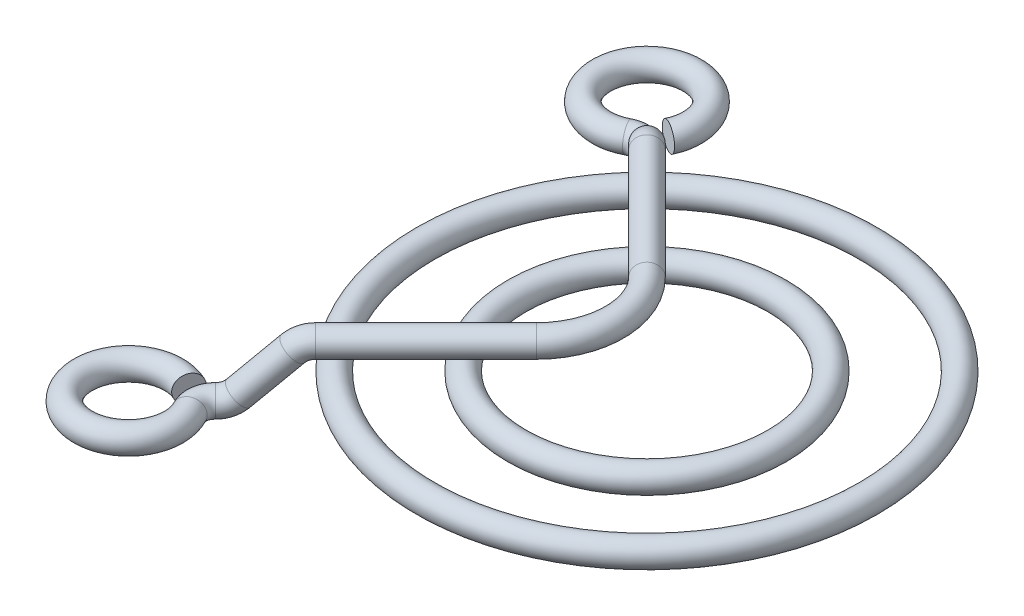
ISO-10303-21;
HEADER;
FILE_DESCRIPTION(('STEP AP214'),'2;1');
FILE_NAME('part.step','',(''),(''),'','','');
FILE_SCHEMA(('AUTOMOTIVE_DESIGN { 1 0 10303 214 1 1 1 1 }'));
ENDSEC;
DATA;
#1=APPLICATION_CONTEXT('core data for automotive mechanical design processes');
#2=APPLICATION_PROTOCOL_DEFINITION('international standard','automotive_design',2000,#1);
#3=PRODUCT_CONTEXT('',#1,'mechanical');
#4=PRODUCT('Part','Part','',(#3));
#5=PRODUCT_RELATED_PRODUCT_CATEGORY('part','',(#4));
#6=PRODUCT_DEFINITION_FORMATION('','',#4);
#7=PRODUCT_DEFINITION_CONTEXT('part definition',#1,'design');
#8=PRODUCT_DEFINITION('design','',#6,#7);
#9=PRODUCT_DEFINITION_SHAPE('','',#8);
#10=(LENGTH_UNIT() NAMED_UNIT(*) SI_UNIT(.MILLI.,.METRE.));
#11=(NAMED_UNIT(*) PLANE_ANGLE_UNIT() SI_UNIT($,.RADIAN.));
#12=(NAMED_UNIT(*) SI_UNIT($,.STERADIAN.) SOLID_ANGLE_UNIT());
#13=UNCERTAINTY_MEASURE_WITH_UNIT(LENGTH_MEASURE(1.E-05),#10,'distance_accuracy_value','');
#14=(GEOMETRIC_REPRESENTATION_CONTEXT(3) GLOBAL_UNCERTAINTY_ASSIGNED_CONTEXT((#13)) GLOBAL_UNIT_ASSIGNED_CONTEXT((#10,
#11,#12)) REPRESENTATION_CONTEXT('',''));
#15=CARTESIAN_POINT('',(0.,0.,0.));
#16=DIRECTION('',(0.,0.,1.));
#17=DIRECTION('',(1.,0.,0.));
#18=AXIS2_PLACEMENT_3D('',#15,#16,#17);
#19=CARTESIAN_POINT('',(-3.41421356237312,4.00000000000001,3.41421356237312));
#20=DIRECTION('',(-0.707106781186549,0.,0.707106781186546));
#21=DIRECTION('',(0.707106781186546,0.,0.707106781186549));
#22=AXIS2_PLACEMENT_3D('',#19,#20,#21);
#23=CYLINDRICAL_SURFACE('',#22,0.799999999999999);
#24=CARTESIAN_POINT('',(-3.41421356237312,4.00000000000001,3.41421356237312));
#25=DIRECTION('',(0.707106781186549,0.,-0.707106781186546));
#26=DIRECTION('',(-0.707106781186546,0.,-0.707106781186549));
#27=AXIS2_PLACEMENT_3D('',#24,#25,#26);
#28=CIRCLE('',#27,0.799999999999999);
#29=CARTESIAN_POINT('',(-2.84852813742388,4.00000000000001,3.97989898732236));
#30=VERTEX_POINT('',#29);
#31=EDGE_CURVE('E11',#30,#30,#28,.T.);
#32=ORIENTED_EDGE('',*,*,#31,.F.);
#33=EDGE_LOOP('',(#32));
#34=FACE_BOUND('',#33,.T.);
#35=CARTESIAN_POINT('',(-10.2247640559575,4.00000000000001,10.2247640559575));
#36=DIRECTION('',(-0.707106781186549,0.,0.707106781186546));
#37=DIRECTION('',(0.707106781186546,0.,0.707106781186549));
#38=AXIS2_PLACEMENT_3D('',#35,#36,#37);
#39=CIRCLE('',#38,0.800000000000011);
#40=CARTESIAN_POINT('',(-10.2247640559575,4.80000000000002,10.2247640559575));
#41=VERTEX_POINT('',#40);
#42=EDGE_CURVE('E58',#41,#41,#39,.T.);
#43=ORIENTED_EDGE('',*,*,#42,.F.);
#44=EDGE_LOOP('',(#43));
#45=FACE_BOUND('',#44,.T.);
#46=ADVANCED_FACE('F39',(#34,#45),#23,.T.);
#47=CARTESIAN_POINT('',(-13.3129942314911,2.2122888634562,13.3129942314911));
#48=DIRECTION('',(-0.707106781186551,0.,-0.707106781186544));
#49=DIRECTION('',(-0.707106781186544,0.,0.707106781186551));
#50=AXIS2_PLACEMENT_3D('',#47,#48,#49);
#51=TOROIDAL_SURFACE('',#50,1.41228886345619,0.800000000000011);
#52=CARTESIAN_POINT('',(-12.6064684576887,1.21418942164284,12.6064684576887));
#53=DIRECTION('',(-0.499729837051592,-0.707488642962405,0.499729837051586));
#54=DIRECTION('',(0.707106781186548,0.,0.707106781186547));
#55=AXIS2_PLACEMENT_3D('',#52,#53,#54);
#56=CIRCLE('',#55,0.800000000000011);
#57=CARTESIAN_POINT('',(-12.2062524440478,0.648809651178146,12.2062524440477));
#58=VERTEX_POINT('',#57);
#59=EDGE_CURVE('E49',#58,#58,#56,.T.);
#60=CARTESIAN_POINT('',(-13.3129942314911,0.800000000000006,13.3129942314911));
#61=DIRECTION('',(-0.707106781186549,0.,0.707106781186546));
#62=DIRECTION('',(0.707106781186546,0.,0.707106781186549));
#63=AXIS2_PLACEMENT_3D('',#60,#61,#62);
#64=CIRCLE('',#63,0.800000000000011);
#65=CARTESIAN_POINT('',(-13.3129942314911,0.,13.3129942314911));
#66=VERTEX_POINT('',#65);
#67=EDGE_CURVE('E45',#66,#66,#64,.T.);
#68=CARTESIAN_POINT('',(-13.3129942314911,2.2122888634562,13.3129942314911));
#69=DIRECTION('',(-0.707106781186551,0.,-0.707106781186544));
#70=DIRECTION('',(-0.707106781186544,0.,0.707106781186551));
#71=AXIS2_PLACEMENT_3D('',#68,#69,#70);
#72=CIRCLE('',#71,2.2122888634562);
#73=EDGE_CURVE('',#58,#66,#72,.T.);
#74=ORIENTED_EDGE('',*,*,#59,.T.);
#75=ORIENTED_EDGE('',*,*,#67,.F.);
#76=ORIENTED_EDGE('',*,*,#73,.T.);
#77=ORIENTED_EDGE('',*,*,#73,.F.);
#78=EDGE_LOOP('',(#74,#76,#75,#77));
#79=FACE_BOUND('',#78,.T.);
#80=ADVANCED_FACE('F116',(#79),#51,.T.);
#81=CARTESIAN_POINT('',(-10.9312898297599,3.58581057835718,10.9312898297599));
#82=DIRECTION('',(-0.499729837051588,-0.707488642962403,0.499729837051592));
#83=DIRECTION('',(0.,-0.576934438438779,-0.816790458895873));
#84=AXIS2_PLACEMENT_3D('',#81,#82,#83);
#85=CYLINDRICAL_SURFACE('',#84,0.800000000000011);
#86=CARTESIAN_POINT('',(-10.9312898297599,3.58581057835718,10.9312898297599));
#87=DIRECTION('',(-0.499729837051592,-0.707488642962405,0.499729837051586));
#88=DIRECTION('',(0.707106781186548,0.,0.707106781186547));
#89=AXIS2_PLACEMENT_3D('',#86,#87,#88);
#90=CIRCLE('',#89,0.800000000000011);
#91=CARTESIAN_POINT('',(-11.3315058434009,4.15119034882187,11.3315058434008));
#92=VERTEX_POINT('',#91);
#93=EDGE_CURVE('E53',#92,#92,#90,.T.);
#94=ORIENTED_EDGE('',*,*,#93,.T.);
#95=EDGE_LOOP('',(#94));
#96=FACE_BOUND('',#95,.T.);
#97=ORIENTED_EDGE('',*,*,#59,.F.);
#98=EDGE_LOOP('',(#97));
#99=FACE_BOUND('',#98,.T.);
#100=ADVANCED_FACE('F121',(#96,#99),#85,.T.);
#101=CARTESIAN_POINT('',(-10.2247640559575,2.58771113654382,10.2247640559575));
#102=DIRECTION('',(-0.707106781186551,0.,-0.707106781186544));
#103=DIRECTION('',(-0.707106781186544,0.,0.707106781186551));
#104=AXIS2_PLACEMENT_3D('',#101,#102,#103);
#105=TOROIDAL_SURFACE('',#104,1.41228886345619,0.800000000000011);
#106=CARTESIAN_POINT('',(-10.2247640559575,2.58771113654382,10.2247640559575));
#107=DIRECTION('',(-0.707106781186551,0.,-0.707106781186544));
#108=DIRECTION('',(-0.707106781186544,0.,0.707106781186551));
#109=AXIS2_PLACEMENT_3D('',#106,#107,#108);
#110=CIRCLE('',#109,2.2122888634562);
#111=EDGE_CURVE('',#92,#41,#110,.T.);
#112=ORIENTED_EDGE('',*,*,#93,.F.);
#113=ORIENTED_EDGE('',*,*,#42,.T.);
#114=ORIENTED_EDGE('',*,*,#111,.T.);
#115=ORIENTED_EDGE('',*,*,#111,.F.);
#116=EDGE_LOOP('',(#112,#114,#113,#115));
#117=FACE_BOUND('',#116,.T.);
#118=ADVANCED_FACE('F126',(#117),#105,.T.);
#119=CARTESIAN_POINT('',(-16.,0.800000000000006,16.));
#120=DIRECTION('',(0.,-1.,0.));
#121=DIRECTION('',(-1.,0.,0.));
#122=AXIS2_PLACEMENT_3D('',#119,#120,#121);
#123=TOROIDAL_SURFACE('',#122,2.79999999999999,0.800000000000002);
#124=CARTESIAN_POINT('',(-13.522460333638,0.800000000000004,14.6954705056602));
#125=DIRECTION('',(0.46590339083566,0.,0.884835595129307));
#126=DIRECTION('',(0.884835595129307,0.,-0.46590339083566));
#127=AXIS2_PLACEMENT_3D('',#124,#125,#126);
#128=CIRCLE('',#127,0.800000000000002);
#129=CARTESIAN_POINT('',(-12.8145918575345,0.800000000000003,14.3227477929916));
#130=VERTEX_POINT('',#129);
#131=EDGE_CURVE('E64',#130,#130,#128,.T.);
#132=CARTESIAN_POINT('',(-14.7971391387377,0.800000000000007,13.4715368801496));
#133=DIRECTION('',(0.903022542803696,0.,0.42959316473653));
#134=DIRECTION('',(0.42959316473653,0.,-0.903022542803696));
#135=AXIS2_PLACEMENT_3D('',#132,#133,#134);
#136=CIRCLE('',#135,0.800000000000002);
#137=CARTESIAN_POINT('',(-14.4534646069485,0.800000000000008,12.7491188459067));
#138=VERTEX_POINT('',#137);
#139=EDGE_CURVE('E61',#138,#138,#136,.T.);
#140=CARTESIAN_POINT('',(-16.,0.800000000000006,16.));
#141=DIRECTION('',(0.,-1.,0.));
#142=DIRECTION('',(-1.,0.,0.));
#143=AXIS2_PLACEMENT_3D('',#140,#141,#142);
#144=CIRCLE('',#143,3.59999999999999);
#145=EDGE_CURVE('',#130,#138,#144,.T.);
#146=ORIENTED_EDGE('',*,*,#131,.T.);
#147=ORIENTED_EDGE('',*,*,#139,.F.);
#148=ORIENTED_EDGE('',*,*,#145,.T.);
#149=ORIENTED_EDGE('',*,*,#145,.F.);
#150=EDGE_LOOP('',(#146,#148,#147,#149));
#151=FACE_BOUND('',#150,.T.);
#152=ADVANCED_FACE('F128',(#151),#123,.T.);
#153=CARTESIAN_POINT('',(-12.4796183822356,0.800000000000003,14.1463700807467));
#154=DIRECTION('',(0.,-1.,0.));
#155=DIRECTION('',(-1.,0.,0.));
#156=AXIS2_PLACEMENT_3D('',#153,#154,#155);
#157=TOROIDAL_SURFACE('',#156,1.17857142857143,0.800000000000002);
#158=ORIENTED_EDGE('',*,*,#131,.F.);
#159=EDGE_LOOP('',(#158));
#160=FACE_BOUND('',#159,.T.);
#161=ORIENTED_EDGE('',*,*,#67,.T.);
#162=EDGE_LOOP('',(#161));
#163=FACE_BOUND('',#162,.T.);
#164=ADVANCED_FACE('F135',(#160,#163),#157,.T.);
#165=CARTESIAN_POINT('',(-14.7971391387377,0.800000000000007,13.4715368801496));
#166=DIRECTION('',(0.903022542803696,0.,0.42959316473653));
#167=DIRECTION('',(0.42959316473653,0.,-0.903022542803696));
#168=AXIS2_PLACEMENT_3D('',#165,#166,#167);
#169=PLANE('',#168);
#170=ORIENTED_EDGE('',*,*,#139,.T.);
#171=EDGE_LOOP('',(#170));
#172=FACE_BOUND('',#171,.T.);
#173=ADVANCED_FACE('F138',(#172),#169,.T.);
#174=CARTESIAN_POINT('',(-6.82842712474626,4.00000000000001,0.));
#175=DIRECTION('',(0.,1.,0.));
#176=DIRECTION('',(0.,0.,1.));
#177=AXIS2_PLACEMENT_3D('',#174,#175,#176);
#178=TOROIDAL_SURFACE('',#177,4.82842712474625,0.799999999999999);
#179=CARTESIAN_POINT('',(-3.4142135623731,4.00000000000001,-3.41421356237314));
#180=DIRECTION('',(0.707106781186544,0.,0.707106781186551));
#181=DIRECTION('',(0.707106781186551,0.,-0.707106781186544));
#182=AXIS2_PLACEMENT_3D('',#179,#180,#181);
#183=CIRCLE('',#182,0.799999999999999);
#184=CARTESIAN_POINT('',(-2.84852813742386,4.00000000000001,-3.97989898732237));
#185=VERTEX_POINT('',#184);
#186=EDGE_CURVE('E67',#185,#185,#183,.T.);
#187=CARTESIAN_POINT('',(-6.82842712474626,4.00000000000001,0.));
#188=DIRECTION('',(0.,1.,0.));
#189=DIRECTION('',(0.,0.,1.));
#190=AXIS2_PLACEMENT_3D('',#187,#188,#189);
#191=CIRCLE('',#190,5.62842712474625);
#192=EDGE_CURVE('',#30,#185,#191,.T.);
#193=ORIENTED_EDGE('',*,*,#31,.T.);
#194=ORIENTED_EDGE('',*,*,#186,.T.);
#195=ORIENTED_EDGE('',*,*,#192,.T.);
#196=ORIENTED_EDGE('',*,*,#192,.F.);
#197=EDGE_LOOP('',(#193,#195,#194,#196));
#198=FACE_BOUND('',#197,.T.);
#199=ADVANCED_FACE('F112',(#198),#178,.T.);
#200=CARTESIAN_POINT('',(-3.4142135623731,4.00000000000001,-3.41421356237314));
#201=DIRECTION('',(-0.707106781186543,0.,-0.707106781186552));
#202=DIRECTION('',(-0.707106781186552,0.,0.707106781186543));
#203=AXIS2_PLACEMENT_3D('',#200,#201,#202);
#204=CYLINDRICAL_SURFACE('',#203,0.799999999999999);
#205=ORIENTED_EDGE('',*,*,#186,.F.);
#206=EDGE_LOOP('',(#205));
#207=FACE_BOUND('',#206,.T.);
#208=CARTESIAN_POINT('',(-10.2247640559574,4.00000000000001,-10.2247640559575));
#209=DIRECTION('',(-0.707106781186543,0.,-0.707106781186552));
#210=DIRECTION('',(-0.707106781186552,0.,0.707106781186543));
#211=AXIS2_PLACEMENT_3D('',#208,#209,#210);
#212=CIRCLE('',#211,0.800000000000011);
#213=CARTESIAN_POINT('',(-10.2247640559574,4.80000000000002,-10.2247640559575));
#214=VERTEX_POINT('',#213);
#215=EDGE_CURVE('E79',#214,#214,#212,.T.);
#216=ORIENTED_EDGE('',*,*,#215,.F.);
#217=EDGE_LOOP('',(#216));
#218=FACE_BOUND('',#217,.T.);
#219=ADVANCED_FACE('F102',(#207,#218),#204,.T.);
#220=CARTESIAN_POINT('',(-13.3129942314911,2.2122888634562,-13.3129942314912));
#221=DIRECTION('',(0.707106781186546,0.,-0.707106781186549));
#222=DIRECTION('',(-0.707106781186549,0.,-0.707106781186546));
#223=AXIS2_PLACEMENT_3D('',#220,#221,#222);
#224=TOROIDAL_SURFACE('',#223,1.41228886345619,0.800000000000011);
#225=CARTESIAN_POINT('',(-12.6064684576886,1.21418942164284,-12.6064684576887));
#226=DIRECTION('',(-0.499729837051585,-0.707488642962405,-0.499729837051593));
#227=DIRECTION('',(-0.70710678118655,0.,0.707106781186546));
#228=AXIS2_PLACEMENT_3D('',#225,#226,#227);
#229=CIRCLE('',#228,0.800000000000011);
#230=CARTESIAN_POINT('',(-12.2062524440477,0.648809651178146,-12.2062524440478));
#231=VERTEX_POINT('',#230);
#232=EDGE_CURVE('E73',#231,#231,#229,.T.);
#233=CARTESIAN_POINT('',(-13.3129942314911,0.800000000000006,-13.3129942314912));
#234=DIRECTION('',(-0.707106781186544,0.,-0.707106781186552));
#235=DIRECTION('',(-0.707106781186552,0.,0.707106781186544));
#236=AXIS2_PLACEMENT_3D('',#233,#234,#235);
#237=CIRCLE('',#236,0.800000000000011);
#238=CARTESIAN_POINT('',(-13.3129942314911,0.,-13.3129942314912));
#239=VERTEX_POINT('',#238);
#240=EDGE_CURVE('E70',#239,#239,#237,.T.);
#241=CARTESIAN_POINT('',(-13.3129942314911,2.2122888634562,-13.3129942314912));
#242=DIRECTION('',(0.707106781186546,0.,-0.707106781186549));
#243=DIRECTION('',(-0.707106781186549,0.,-0.707106781186546));
#244=AXIS2_PLACEMENT_3D('',#241,#242,#243);
#245=CIRCLE('',#244,2.2122888634562);
#246=EDGE_CURVE('',#231,#239,#245,.T.);
#247=ORIENTED_EDGE('',*,*,#232,.T.);
#248=ORIENTED_EDGE('',*,*,#240,.F.);
#249=ORIENTED_EDGE('',*,*,#246,.T.);
#250=ORIENTED_EDGE('',*,*,#246,.F.);
#251=EDGE_LOOP('',(#247,#249,#248,#250));
#252=FACE_BOUND('',#251,.T.);
#253=ADVANCED_FACE('F99',(#252),#224,.T.);
#254=CARTESIAN_POINT('',(-10.9312898297598,3.58581057835718,-10.93128982976));
#255=DIRECTION('',(-0.499729837051592,-0.707488642962403,-0.499729837051588));
#256=DIRECTION('',(0.816790458895872,-0.57693443843878,0.));
#257=AXIS2_PLACEMENT_3D('',#254,#255,#256);
#258=CYLINDRICAL_SURFACE('',#257,0.800000000000011);
#259=CARTESIAN_POINT('',(-10.9312898297598,3.58581057835718,-10.93128982976));
#260=DIRECTION('',(-0.499729837051585,-0.707488642962405,-0.499729837051593));
#261=DIRECTION('',(-0.70710678118655,0.,0.707106781186546));
#262=AXIS2_PLACEMENT_3D('',#259,#260,#261);
#263=CIRCLE('',#262,0.800000000000011);
#264=CARTESIAN_POINT('',(-11.3315058434008,4.15119034882187,-11.3315058434009));
#265=VERTEX_POINT('',#264);
#266=EDGE_CURVE('E76',#265,#265,#263,.T.);
#267=ORIENTED_EDGE('',*,*,#266,.T.);
#268=EDGE_LOOP('',(#267));
#269=FACE_BOUND('',#268,.T.);
#270=ORIENTED_EDGE('',*,*,#232,.F.);
#271=EDGE_LOOP('',(#270));
#272=FACE_BOUND('',#271,.T.);
#273=ADVANCED_FACE('F101',(#269,#272),#258,.T.);
#274=CARTESIAN_POINT('',(-10.2247640559574,2.58771113654382,-10.2247640559575));
#275=DIRECTION('',(0.707106781186546,0.,-0.707106781186549));
#276=DIRECTION('',(-0.707106781186549,0.,-0.707106781186546));
#277=AXIS2_PLACEMENT_3D('',#274,#275,#276);
#278=TOROIDAL_SURFACE('',#277,1.41228886345619,0.800000000000011);
#279=CARTESIAN_POINT('',(-10.2247640559574,2.58771113654382,-10.2247640559575));
#280=DIRECTION('',(0.707106781186546,0.,-0.707106781186549));
#281=DIRECTION('',(-0.707106781186549,0.,-0.707106781186546));
#282=AXIS2_PLACEMENT_3D('',#279,#280,#281);
#283=CIRCLE('',#282,2.2122888634562);
#284=EDGE_CURVE('',#265,#214,#283,.T.);
#285=ORIENTED_EDGE('',*,*,#266,.F.);
#286=ORIENTED_EDGE('',*,*,#215,.T.);
#287=ORIENTED_EDGE('',*,*,#284,.T.);
#288=ORIENTED_EDGE('',*,*,#284,.F.);
#289=EDGE_LOOP('',(#285,#287,#286,#288));
#290=FACE_BOUND('',#289,.T.);
#291=ADVANCED_FACE('F109',(#290),#278,.T.);
#292=CARTESIAN_POINT('',(-15.9999999999999,0.800000000000006,-16.0000000000001));
#293=DIRECTION('',(0.,-1.,0.));
#294=DIRECTION('',(0.,0.,-1.));
#295=AXIS2_PLACEMENT_3D('',#292,#293,#294);
#296=TOROIDAL_SURFACE('',#295,2.79999999999999,0.800000000000002);
#297=CARTESIAN_POINT('',(-14.6954705056601,0.800000000000006,-13.522460333638));
#298=DIRECTION('',(-0.884835595129308,0.,0.465903390835657));
#299=DIRECTION('',(0.465903390835657,0.,0.884835595129308));
#300=AXIS2_PLACEMENT_3D('',#297,#298,#299);
#301=CIRCLE('',#300,0.800000000000002);
#302=CARTESIAN_POINT('',(-14.3227477929916,0.800000000000006,-12.8145918575346));
#303=VERTEX_POINT('',#302);
#304=EDGE_CURVE('E85',#303,#303,#301,.T.);
#305=CARTESIAN_POINT('',(-13.4715368801496,0.800000000000006,-14.7971391387378));
#306=DIRECTION('',(-0.429593164736533,0.,0.903022542803694));
#307=DIRECTION('',(0.903022542803694,0.,0.429593164736533));
#308=AXIS2_PLACEMENT_3D('',#305,#306,#307);
#309=CIRCLE('',#308,0.800000000000002);
#310=CARTESIAN_POINT('',(-12.7491188459066,0.800000000000006,-14.4534646069485));
#311=VERTEX_POINT('',#310);
#312=EDGE_CURVE('E82',#311,#311,#309,.T.);
#313=CARTESIAN_POINT('',(-15.9999999999999,0.800000000000006,-16.0000000000001));
#314=DIRECTION('',(0.,-1.,0.));
#315=DIRECTION('',(0.,0.,-1.));
#316=AXIS2_PLACEMENT_3D('',#313,#314,#315);
#317=CIRCLE('',#316,3.59999999999999);
#318=EDGE_CURVE('',#303,#311,#317,.T.);
#319=ORIENTED_EDGE('',*,*,#304,.T.);
#320=ORIENTED_EDGE('',*,*,#312,.F.);
#321=ORIENTED_EDGE('',*,*,#318,.T.);
#322=ORIENTED_EDGE('',*,*,#318,.F.);
#323=EDGE_LOOP('',(#319,#321,#320,#322));
#324=FACE_BOUND('',#323,.T.);
#325=ADVANCED_FACE('F89',(#324),#296,.T.);
#326=CARTESIAN_POINT('',(-14.1463700807467,0.800000000000006,-12.4796183822356));
#327=DIRECTION('',(0.,-1.,0.));
#328=DIRECTION('',(0.,0.,-1.));
#329=AXIS2_PLACEMENT_3D('',#326,#327,#328);
#330=TOROIDAL_SURFACE('',#329,1.17857142857143,0.800000000000002);
#331=ORIENTED_EDGE('',*,*,#304,.F.);
#332=EDGE_LOOP('',(#331));
#333=FACE_BOUND('',#332,.T.);
#334=ORIENTED_EDGE('',*,*,#240,.T.);
#335=EDGE_LOOP('',(#334));
#336=FACE_BOUND('',#335,.T.);
#337=ADVANCED_FACE('F92',(#333,#336),#330,.T.);
#338=CARTESIAN_POINT('',(-13.4715368801496,0.800000000000006,-14.7971391387378));
#339=DIRECTION('',(-0.429593164736533,0.,0.903022542803694));
#340=DIRECTION('',(0.903022542803694,0.,0.429593164736533));
#341=AXIS2_PLACEMENT_3D('',#338,#339,#340);
#342=PLANE('',#341);
#343=ORIENTED_EDGE('',*,*,#312,.T.);
#344=EDGE_LOOP('',(#343));
#345=FACE_BOUND('',#344,.T.);
#346=ADVANCED_FACE('F95',(#345),#342,.T.);
#347=CLOSED_SHELL('',(#46,#80,#100,#118,#152,#164,#173,#199,#219,#253,#273,#291,#325,#337,#346));
#348=MANIFOLD_SOLID_BREP('B2',#347);
#349=CARTESIAN_POINT('',(0.,2.39999999999999,0.));
#350=DIRECTION('',(0.,1.,0.));
#351=DIRECTION('',(-1.,0.,0.));
#352=AXIS2_PLACEMENT_3D('',#349,#350,#351);
#353=TOROIDAL_SURFACE('',#352,13.65,0.799999999999999);
#354=CARTESIAN_POINT('',(-14.45,2.40000000000001,0.));
#355=VERTEX_POINT('',#354);
#356=VERTEX_LOOP('',#355);
#357=FACE_BOUND('',#356,.T.);
#358=ADVANCED_FACE('F264',(#357),#353,.T.);
#359=CLOSED_SHELL('',(#358));
#360=MANIFOLD_SOLID_BREP('B6',#359);
#361=CARTESIAN_POINT('',(0.,2.4,0.));
#362=DIRECTION('',(0.,1.,0.));
#363=DIRECTION('',(-1.,0.,0.));
#364=AXIS2_PLACEMENT_3D('',#361,#362,#363);
#365=TOROIDAL_SURFACE('',#364,8.02499999999999,0.799999999999999);
#366=CARTESIAN_POINT('',(-8.82499999999999,2.40000000000001,0.));
#367=VERTEX_POINT('',#366);
#368=VERTEX_LOOP('',#367);
#369=FACE_BOUND('',#368,.T.);
#370=ADVANCED_FACE('F276',(#369),#365,.T.);
#371=CLOSED_SHELL('',(#370));
#372=MANIFOLD_SOLID_BREP('B35',#371);
#373=ADVANCED_BREP_SHAPE_REPRESENTATION('',(#18,#348,#360,#372),#14);
#374=SHAPE_DEFINITION_REPRESENTATION(#9,#373);
ENDSEC;
END-ISO-10303-21;
